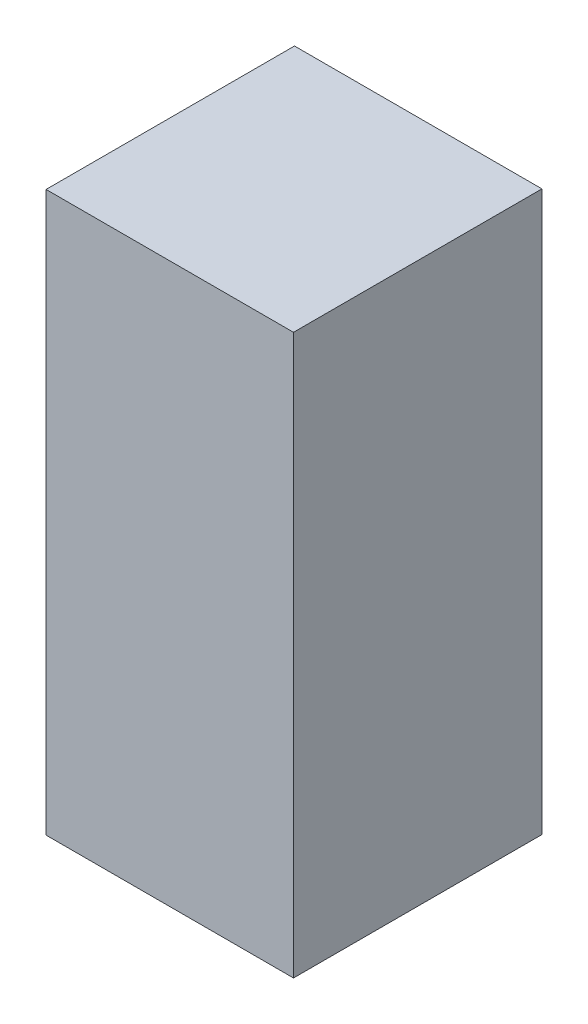
ISO-10303-21;
HEADER;
FILE_DESCRIPTION(('STEP AP214'),'2;1');
FILE_NAME('part.step','',(''),(''),'','','');
FILE_SCHEMA(('AUTOMOTIVE_DESIGN { 1 0 10303 214 1 1 1 1 }'));
ENDSEC;
DATA;
#1=APPLICATION_CONTEXT('core data for automotive mechanical design processes');
#2=APPLICATION_PROTOCOL_DEFINITION('international standard','automotive_design',2000,#1);
#3=PRODUCT_CONTEXT('',#1,'mechanical');
#4=PRODUCT('Part','Part','',(#3));
#5=PRODUCT_RELATED_PRODUCT_CATEGORY('part','',(#4));
#6=PRODUCT_DEFINITION_FORMATION('','',#4);
#7=PRODUCT_DEFINITION_CONTEXT('part definition',#1,'design');
#8=PRODUCT_DEFINITION('design','',#6,#7);
#9=PRODUCT_DEFINITION_SHAPE('','',#8);
#10=(LENGTH_UNIT() NAMED_UNIT(*) SI_UNIT(.MILLI.,.METRE.));
#11=(NAMED_UNIT(*) PLANE_ANGLE_UNIT() SI_UNIT($,.RADIAN.));
#12=(NAMED_UNIT(*) SI_UNIT($,.STERADIAN.) SOLID_ANGLE_UNIT());
#13=UNCERTAINTY_MEASURE_WITH_UNIT(LENGTH_MEASURE(1.E-05),#10,'distance_accuracy_value','');
#14=(GEOMETRIC_REPRESENTATION_CONTEXT(3) GLOBAL_UNCERTAINTY_ASSIGNED_CONTEXT((#13)) GLOBAL_UNIT_ASSIGNED_CONTEXT((#10,
#11,#12)) REPRESENTATION_CONTEXT('',''));
#15=CARTESIAN_POINT('',(0.,0.,0.));
#16=DIRECTION('',(0.,0.,1.));
#17=DIRECTION('',(1.,0.,0.));
#18=AXIS2_PLACEMENT_3D('',#15,#16,#17);
#19=CARTESIAN_POINT('',(1.88795,-2.53755,0.));
#20=DIRECTION('',(1.,0.,0.));
#21=DIRECTION('',(0.,0.,1.));
#22=AXIS2_PLACEMENT_3D('',#19,#20,#21);
#23=PLANE('',#22);
#24=DIRECTION('',(0.,1.,0.));
#25=VECTOR('',#24,1.);
#26=CARTESIAN_POINT('',(1.88795,-2.53755,0.1));
#27=LINE('',#26,#25);
#28=CARTESIAN_POINT('',(1.88795,-2.53755,0.1));
#29=VERTEX_POINT('',#28);
#30=CARTESIAN_POINT('',(1.88795,-2.31245,0.1));
#31=VERTEX_POINT('',#30);
#32=EDGE_CURVE('E11',#29,#31,#27,.T.);
#33=ORIENTED_EDGE('',*,*,#32,.T.);
#34=DIRECTION('',(0.,0.,1.));
#35=VECTOR('',#34,1.);
#36=CARTESIAN_POINT('',(1.88795,-2.31245,0.));
#37=LINE('',#36,#35);
#38=CARTESIAN_POINT('',(1.88795,-2.31245,0.));
#39=VERTEX_POINT('',#38);
#40=EDGE_CURVE('E24',#39,#31,#37,.T.);
#41=ORIENTED_EDGE('',*,*,#40,.F.);
#42=DIRECTION('',(0.,1.,0.));
#43=VECTOR('',#42,1.);
#44=CARTESIAN_POINT('',(1.88795,-2.53755,0.));
#45=LINE('',#44,#43);
#46=CARTESIAN_POINT('',(1.88795,-2.53755,0.));
#47=VERTEX_POINT('',#46);
#48=EDGE_CURVE('E86',#47,#39,#45,.T.);
#49=ORIENTED_EDGE('',*,*,#48,.F.);
#50=DIRECTION('',(0.,0.,1.));
#51=VECTOR('',#50,1.);
#52=CARTESIAN_POINT('',(1.88795,-2.53755,0.));
#53=LINE('',#52,#51);
#54=EDGE_CURVE('E36',#47,#29,#53,.T.);
#55=ORIENTED_EDGE('',*,*,#54,.T.);
#56=EDGE_LOOP('',(#33,#41,#49,#55));
#57=FACE_BOUND('',#56,.T.);
#58=ADVANCED_FACE('F17',(#57),#23,.F.);
#59=CARTESIAN_POINT('',(1.98755,-2.53755,0.));
#60=DIRECTION('',(1.,0.,0.));
#61=DIRECTION('',(0.,0.,1.));
#62=AXIS2_PLACEMENT_3D('',#59,#60,#61);
#63=PLANE('',#62);
#64=DIRECTION('',(0.,0.,1.));
#65=VECTOR('',#64,1.);
#66=CARTESIAN_POINT('',(1.98755,-2.53755,0.));
#67=LINE('',#66,#65);
#68=CARTESIAN_POINT('',(1.98755,-2.53755,0.));
#69=VERTEX_POINT('',#68);
#70=CARTESIAN_POINT('',(1.98755,-2.53755,0.1));
#71=VERTEX_POINT('',#70);
#72=EDGE_CURVE('E83',#69,#71,#67,.T.);
#73=ORIENTED_EDGE('',*,*,#72,.F.);
#74=DIRECTION('',(0.,1.,0.));
#75=VECTOR('',#74,1.);
#76=CARTESIAN_POINT('',(1.98755,-2.53755,0.));
#77=LINE('',#76,#75);
#78=CARTESIAN_POINT('',(1.98755,-2.31245,0.));
#79=VERTEX_POINT('',#78);
#80=EDGE_CURVE('E63',#69,#79,#77,.T.);
#81=ORIENTED_EDGE('',*,*,#80,.T.);
#82=DIRECTION('',(0.,0.,1.));
#83=VECTOR('',#82,1.);
#84=CARTESIAN_POINT('',(1.98755,-2.31245,0.));
#85=LINE('',#84,#83);
#86=CARTESIAN_POINT('',(1.98755,-2.31245,0.1));
#87=VERTEX_POINT('',#86);
#88=EDGE_CURVE('E57',#79,#87,#85,.T.);
#89=ORIENTED_EDGE('',*,*,#88,.T.);
#90=DIRECTION('',(0.,1.,0.));
#91=VECTOR('',#90,1.);
#92=CARTESIAN_POINT('',(1.98755,-2.53755,0.1));
#93=LINE('',#92,#91);
#94=EDGE_CURVE('E60',#71,#87,#93,.T.);
#95=ORIENTED_EDGE('',*,*,#94,.F.);
#96=EDGE_LOOP('',(#73,#81,#89,#95));
#97=FACE_BOUND('',#96,.T.);
#98=ADVANCED_FACE('F59',(#97),#63,.T.);
#99=CARTESIAN_POINT('',(1.88795,-2.53755,0.));
#100=DIRECTION('',(0.,1.,0.));
#101=DIRECTION('',(0.,0.,1.));
#102=AXIS2_PLACEMENT_3D('',#99,#100,#101);
#103=PLANE('',#102);
#104=ORIENTED_EDGE('',*,*,#72,.T.);
#105=DIRECTION('',(1.,0.,0.));
#106=VECTOR('',#105,1.);
#107=CARTESIAN_POINT('',(1.88795,-2.53755,0.1));
#108=LINE('',#107,#106);
#109=EDGE_CURVE('E71',#29,#71,#108,.T.);
#110=ORIENTED_EDGE('',*,*,#109,.F.);
#111=ORIENTED_EDGE('',*,*,#54,.F.);
#112=DIRECTION('',(1.,0.,0.));
#113=VECTOR('',#112,1.);
#114=CARTESIAN_POINT('',(1.88795,-2.53755,0.));
#115=LINE('',#114,#113);
#116=EDGE_CURVE('E76',#47,#69,#115,.T.);
#117=ORIENTED_EDGE('',*,*,#116,.T.);
#118=EDGE_LOOP('',(#104,#110,#111,#117));
#119=FACE_BOUND('',#118,.T.);
#120=ADVANCED_FACE('F91',(#119),#103,.F.);
#121=CARTESIAN_POINT('',(1.88795,-2.31245,0.));
#122=DIRECTION('',(0.,1.,0.));
#123=DIRECTION('',(0.,0.,1.));
#124=AXIS2_PLACEMENT_3D('',#121,#122,#123);
#125=PLANE('',#124);
#126=DIRECTION('',(1.,0.,0.));
#127=VECTOR('',#126,1.);
#128=CARTESIAN_POINT('',(1.88795,-2.31245,0.));
#129=LINE('',#128,#127);
#130=EDGE_CURVE('E74',#39,#79,#129,.T.);
#131=ORIENTED_EDGE('',*,*,#130,.F.);
#132=ORIENTED_EDGE('',*,*,#40,.T.);
#133=DIRECTION('',(1.,0.,0.));
#134=VECTOR('',#133,1.);
#135=CARTESIAN_POINT('',(1.88795,-2.31245,0.1));
#136=LINE('',#135,#134);
#137=EDGE_CURVE('E69',#31,#87,#136,.T.);
#138=ORIENTED_EDGE('',*,*,#137,.T.);
#139=ORIENTED_EDGE('',*,*,#88,.F.);
#140=EDGE_LOOP('',(#131,#132,#138,#139));
#141=FACE_BOUND('',#140,.T.);
#142=ADVANCED_FACE('F73',(#141),#125,.T.);
#143=CARTESIAN_POINT('',(1.88795,-2.53755,0.));
#144=DIRECTION('',(0.,0.,1.));
#145=DIRECTION('',(1.,0.,0.));
#146=AXIS2_PLACEMENT_3D('',#143,#144,#145);
#147=PLANE('',#146);
#148=ORIENTED_EDGE('',*,*,#130,.T.);
#149=ORIENTED_EDGE('',*,*,#80,.F.);
#150=ORIENTED_EDGE('',*,*,#116,.F.);
#151=ORIENTED_EDGE('',*,*,#48,.T.);
#152=EDGE_LOOP('',(#148,#149,#150,#151));
#153=FACE_BOUND('',#152,.T.);
#154=ADVANCED_FACE('F89',(#153),#147,.F.);
#155=CARTESIAN_POINT('',(1.88795,-2.53755,0.1));
#156=DIRECTION('',(0.,0.,1.));
#157=DIRECTION('',(1.,0.,0.));
#158=AXIS2_PLACEMENT_3D('',#155,#156,#157);
#159=PLANE('',#158);
#160=ORIENTED_EDGE('',*,*,#32,.F.);
#161=ORIENTED_EDGE('',*,*,#109,.T.);
#162=ORIENTED_EDGE('',*,*,#94,.T.);
#163=ORIENTED_EDGE('',*,*,#137,.F.);
#164=EDGE_LOOP('',(#160,#161,#162,#163));
#165=FACE_BOUND('',#164,.T.);
#166=ADVANCED_FACE('F68',(#165),#159,.T.);
#167=CLOSED_SHELL('',(#58,#98,#120,#142,#154,#166));
#168=MANIFOLD_SOLID_BREP('B1',#167);
#169=ADVANCED_BREP_SHAPE_REPRESENTATION('',(#18,#168),#14);
#170=SHAPE_DEFINITION_REPRESENTATION(#9,#169);
ENDSEC;
END-ISO-10303-21;
